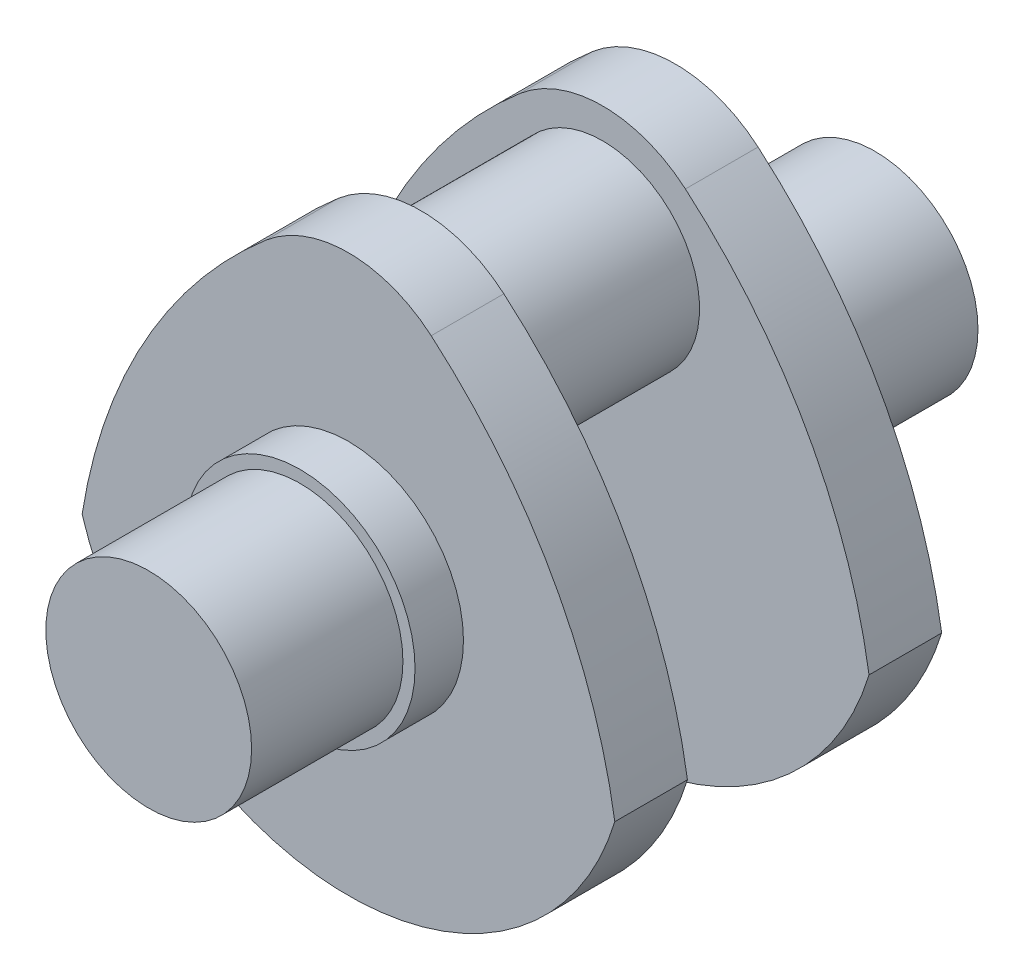
ISO-10303-21;
HEADER;
FILE_DESCRIPTION(('STEP AP214'),'2;1');
FILE_NAME('part.step','',(''),(''),'','','');
FILE_SCHEMA(('AUTOMOTIVE_DESIGN { 1 0 10303 214 1 1 1 1 }'));
ENDSEC;
DATA;
#1=APPLICATION_CONTEXT('core data for automotive mechanical design processes');
#2=APPLICATION_PROTOCOL_DEFINITION('international standard','automotive_design',2000,#1);
#3=PRODUCT_CONTEXT('',#1,'mechanical');
#4=PRODUCT('Part','Part','',(#3));
#5=PRODUCT_RELATED_PRODUCT_CATEGORY('part','',(#4));
#6=PRODUCT_DEFINITION_FORMATION('','',#4);
#7=PRODUCT_DEFINITION_CONTEXT('part definition',#1,'design');
#8=PRODUCT_DEFINITION('design','',#6,#7);
#9=PRODUCT_DEFINITION_SHAPE('','',#8);
#10=(LENGTH_UNIT() NAMED_UNIT(*) SI_UNIT(.MILLI.,.METRE.));
#11=(NAMED_UNIT(*) PLANE_ANGLE_UNIT() SI_UNIT($,.RADIAN.));
#12=(NAMED_UNIT(*) SI_UNIT($,.STERADIAN.) SOLID_ANGLE_UNIT());
#13=UNCERTAINTY_MEASURE_WITH_UNIT(LENGTH_MEASURE(1.E-05),#10,'distance_accuracy_value','');
#14=(GEOMETRIC_REPRESENTATION_CONTEXT(3) GLOBAL_UNCERTAINTY_ASSIGNED_CONTEXT((#13)) GLOBAL_UNIT_ASSIGNED_CONTEXT((#10,
#11,#12)) REPRESENTATION_CONTEXT('',''));
#15=CARTESIAN_POINT('',(0.,0.,0.));
#16=DIRECTION('',(0.,0.,1.));
#17=DIRECTION('',(1.,0.,0.));
#18=AXIS2_PLACEMENT_3D('',#15,#16,#17);
#19=CARTESIAN_POINT('',(0.,0.,250.));
#20=DIRECTION('',(0.,0.,-1.));
#21=DIRECTION('',(-1.,0.,0.));
#22=AXIS2_PLACEMENT_3D('',#19,#20,#21);
#23=CYLINDRICAL_SURFACE('',#22,170.);
#24=CARTESIAN_POINT('',(0.,0.,250.));
#25=DIRECTION('',(0.,0.,1.));
#26=DIRECTION('',(1.,0.,0.));
#27=AXIS2_PLACEMENT_3D('',#24,#25,#26);
#28=CIRCLE('',#27,170.);
#29=CARTESIAN_POINT('',(170.,0.,250.));
#30=VERTEX_POINT('',#29);
#31=EDGE_CURVE('E11',#30,#30,#28,.T.);
#32=ORIENTED_EDGE('',*,*,#31,.F.);
#33=EDGE_LOOP('',(#32));
#34=FACE_BOUND('',#33,.T.);
#35=CARTESIAN_POINT('',(0.,0.,0.));
#36=DIRECTION('',(0.,0.,1.));
#37=DIRECTION('',(1.,0.,0.));
#38=AXIS2_PLACEMENT_3D('',#35,#36,#37);
#39=CIRCLE('',#38,170.);
#40=CARTESIAN_POINT('',(170.,0.,0.));
#41=VERTEX_POINT('',#40);
#42=EDGE_CURVE('E42',#41,#41,#39,.T.);
#43=ORIENTED_EDGE('',*,*,#42,.T.);
#44=EDGE_LOOP('',(#43));
#45=FACE_BOUND('',#44,.T.);
#46=ADVANCED_FACE('F39',(#34,#45),#23,.T.);
#47=CARTESIAN_POINT('',(0.,0.,250.));
#48=DIRECTION('',(0.,0.,1.));
#49=DIRECTION('',(1.,0.,0.));
#50=AXIS2_PLACEMENT_3D('',#47,#48,#49);
#51=PLANE('',#50);
#52=ORIENTED_EDGE('',*,*,#31,.T.);
#53=EDGE_LOOP('',(#52));
#54=FACE_BOUND('',#53,.T.);
#55=ADVANCED_FACE('F248',(#54),#51,.T.);
#56=CARTESIAN_POINT('',(0.,0.,-80.));
#57=DIRECTION('',(0.,0.,1.));
#58=DIRECTION('',(1.,0.,0.));
#59=AXIS2_PLACEMENT_3D('',#56,#57,#58);
#60=CYLINDRICAL_SURFACE('',#59,190.);
#61=CARTESIAN_POINT('',(0.,0.,-80.));
#62=DIRECTION('',(0.,0.,-1.));
#63=DIRECTION('',(-1.,0.,0.));
#64=AXIS2_PLACEMENT_3D('',#61,#62,#63);
#65=CIRCLE('',#64,190.);
#66=CARTESIAN_POINT('',(-190.,0.,-80.));
#67=VERTEX_POINT('',#66);
#68=EDGE_CURVE('E226',#67,#67,#65,.T.);
#69=ORIENTED_EDGE('',*,*,#68,.F.);
#70=EDGE_LOOP('',(#69));
#71=FACE_BOUND('',#70,.T.);
#72=CARTESIAN_POINT('',(0.,0.,0.));
#73=DIRECTION('',(0.,0.,-1.));
#74=DIRECTION('',(-1.,0.,0.));
#75=AXIS2_PLACEMENT_3D('',#72,#73,#74);
#76=CIRCLE('',#75,190.);
#77=CARTESIAN_POINT('',(-190.,0.,0.));
#78=VERTEX_POINT('',#77);
#79=EDGE_CURVE('E225',#78,#78,#76,.T.);
#80=ORIENTED_EDGE('',*,*,#79,.T.);
#81=EDGE_LOOP('',(#80));
#82=FACE_BOUND('',#81,.T.);
#83=ADVANCED_FACE('F234',(#71,#82),#60,.T.);
#84=CARTESIAN_POINT('',(0.,0.,0.));
#85=DIRECTION('',(0.,0.,-1.));
#86=DIRECTION('',(-1.,0.,0.));
#87=AXIS2_PLACEMENT_3D('',#84,#85,#86);
#88=PLANE('',#87);
#89=ORIENTED_EDGE('',*,*,#42,.F.);
#90=EDGE_LOOP('',(#89));
#91=FACE_BOUND('',#90,.T.);
#92=ORIENTED_EDGE('',*,*,#79,.F.);
#93=EDGE_LOOP('',(#92));
#94=FACE_BOUND('',#93,.T.);
#95=ADVANCED_FACE('F236',(#91,#94),#88,.F.);
#96=CARTESIAN_POINT('',(-449.094542035734,-273.845485151599,-200.));
#97=DIRECTION('',(0.,0.,1.));
#98=DIRECTION('',(1.,0.,0.));
#99=AXIS2_PLACEMENT_3D('',#96,#97,#98);
#100=CYLINDRICAL_SURFACE('',#99,900.);
#101=CARTESIAN_POINT('',(-449.094542035734,-273.845485151599,-80.));
#102=DIRECTION('',(0.,0.,-1.));
#103=DIRECTION('',(-1.,0.,0.));
#104=AXIS2_PLACEMENT_3D('',#101,#102,#103);
#105=CIRCLE('',#104,900.);
#106=CARTESIAN_POINT('',(136.680947576093,409.431234611356,-80.));
#107=VERTEX_POINT('',#106);
#108=CARTESIAN_POINT('',(440.,-134.164078649987,-80.));
#109=VERTEX_POINT('',#108);
#110=EDGE_CURVE('E192',#107,#109,#105,.T.);
#111=ORIENTED_EDGE('',*,*,#110,.T.);
#112=DIRECTION('',(0.,0.,1.));
#113=VECTOR('',#112,1.);
#114=CARTESIAN_POINT('',(440.,-134.164078649987,-200.));
#115=LINE('',#114,#113);
#116=CARTESIAN_POINT('',(440.,-134.164078649987,-200.));
#117=VERTEX_POINT('',#116);
#118=EDGE_CURVE('E222',#117,#109,#115,.T.);
#119=ORIENTED_EDGE('',*,*,#118,.F.);
#120=CARTESIAN_POINT('',(-449.094542035734,-273.845485151599,-200.));
#121=DIRECTION('',(0.,0.,-1.));
#122=DIRECTION('',(-1.,0.,0.));
#123=AXIS2_PLACEMENT_3D('',#120,#121,#122);
#124=CIRCLE('',#123,900.);
#125=CARTESIAN_POINT('',(136.680947576093,409.431234611356,-200.));
#126=VERTEX_POINT('',#125);
#127=EDGE_CURVE('E193',#126,#117,#124,.T.);
#128=ORIENTED_EDGE('',*,*,#127,.F.);
#129=DIRECTION('',(0.,0.,1.));
#130=VECTOR('',#129,1.);
#131=CARTESIAN_POINT('',(136.680947576093,409.431234611356,-200.));
#132=LINE('',#131,#130);
#133=EDGE_CURVE('E203',#126,#107,#132,.T.);
#134=ORIENTED_EDGE('',*,*,#133,.T.);
#135=EDGE_LOOP('',(#111,#119,#128,#134));
#136=FACE_BOUND('',#135,.T.);
#137=ADVANCED_FACE('F238',(#136),#100,.T.);
#138=CARTESIAN_POINT('',(0.,0.,-200.));
#139=DIRECTION('',(0.,0.,1.));
#140=DIRECTION('',(1.,0.,0.));
#141=AXIS2_PLACEMENT_3D('',#138,#139,#140);
#142=CYLINDRICAL_SURFACE('',#141,460.);
#143=CARTESIAN_POINT('',(0.,0.,-80.));
#144=DIRECTION('',(0.,0.,-1.));
#145=DIRECTION('',(-1.,0.,0.));
#146=AXIS2_PLACEMENT_3D('',#143,#144,#145);
#147=CIRCLE('',#146,460.);
#148=CARTESIAN_POINT('',(-440.,-134.164078649987,-80.));
#149=VERTEX_POINT('',#148);
#150=EDGE_CURVE('E207',#109,#149,#147,.T.);
#151=ORIENTED_EDGE('',*,*,#150,.T.);
#152=DIRECTION('',(0.,0.,1.));
#153=VECTOR('',#152,1.);
#154=CARTESIAN_POINT('',(-440.,-134.164078649987,-200.));
#155=LINE('',#154,#153);
#156=CARTESIAN_POINT('',(-440.,-134.164078649987,-200.));
#157=VERTEX_POINT('',#156);
#158=EDGE_CURVE('E219',#157,#149,#155,.T.);
#159=ORIENTED_EDGE('',*,*,#158,.F.);
#160=CARTESIAN_POINT('',(0.,0.,-200.));
#161=DIRECTION('',(0.,0.,-1.));
#162=DIRECTION('',(-1.,0.,0.));
#163=AXIS2_PLACEMENT_3D('',#160,#161,#162);
#164=CIRCLE('',#163,460.);
#165=EDGE_CURVE('E88',#117,#157,#164,.T.);
#166=ORIENTED_EDGE('',*,*,#165,.F.);
#167=ORIENTED_EDGE('',*,*,#118,.T.);
#168=EDGE_LOOP('',(#151,#159,#166,#167));
#169=FACE_BOUND('',#168,.T.);
#170=ADVANCED_FACE('F245',(#169),#142,.T.);
#171=CARTESIAN_POINT('',(449.094542035734,-273.845485151599,-200.));
#172=DIRECTION('',(0.,0.,1.));
#173=DIRECTION('',(1.,0.,0.));
#174=AXIS2_PLACEMENT_3D('',#171,#172,#173);
#175=CYLINDRICAL_SURFACE('',#174,900.);
#176=CARTESIAN_POINT('',(449.094542035734,-273.845485151599,-80.));
#177=DIRECTION('',(0.,0.,-1.));
#178=DIRECTION('',(1.,0.,0.));
#179=AXIS2_PLACEMENT_3D('',#176,#177,#178);
#180=CIRCLE('',#179,900.);
#181=CARTESIAN_POINT('',(-136.680947576093,409.431234611356,-80.));
#182=VERTEX_POINT('',#181);
#183=EDGE_CURVE('E74',#149,#182,#180,.T.);
#184=ORIENTED_EDGE('',*,*,#183,.T.);
#185=DIRECTION('',(0.,0.,1.));
#186=VECTOR('',#185,1.);
#187=CARTESIAN_POINT('',(-136.680947576093,409.431234611356,-200.));
#188=LINE('',#187,#186);
#189=CARTESIAN_POINT('',(-136.680947576093,409.431234611356,-200.));
#190=VERTEX_POINT('',#189);
#191=EDGE_CURVE('E216',#190,#182,#188,.T.);
#192=ORIENTED_EDGE('',*,*,#191,.F.);
#193=CARTESIAN_POINT('',(449.094542035734,-273.845485151599,-200.));
#194=DIRECTION('',(0.,0.,-1.));
#195=DIRECTION('',(1.,0.,0.));
#196=AXIS2_PLACEMENT_3D('',#193,#194,#195);
#197=CIRCLE('',#196,900.);
#198=EDGE_CURVE('E198',#157,#190,#197,.T.);
#199=ORIENTED_EDGE('',*,*,#198,.F.);
#200=ORIENTED_EDGE('',*,*,#158,.T.);
#201=EDGE_LOOP('',(#184,#192,#199,#200));
#202=FACE_BOUND('',#201,.T.);
#203=ADVANCED_FACE('F287',(#202),#175,.T.);
#204=CARTESIAN_POINT('',(0.,250.,-200.));
#205=DIRECTION('',(0.,0.,1.));
#206=DIRECTION('',(1.,0.,0.));
#207=AXIS2_PLACEMENT_3D('',#204,#205,#206);
#208=CYLINDRICAL_SURFACE('',#207,210.);
#209=CARTESIAN_POINT('',(0.,250.,-80.));
#210=DIRECTION('',(0.,0.,-1.));
#211=DIRECTION('',(-1.,0.,0.));
#212=AXIS2_PLACEMENT_3D('',#209,#210,#211);
#213=CIRCLE('',#212,210.);
#214=EDGE_CURVE('E80',#182,#107,#213,.T.);
#215=ORIENTED_EDGE('',*,*,#214,.T.);
#216=ORIENTED_EDGE('',*,*,#133,.F.);
#217=CARTESIAN_POINT('',(0.,250.,-200.));
#218=DIRECTION('',(0.,0.,-1.));
#219=DIRECTION('',(-1.,0.,0.));
#220=AXIS2_PLACEMENT_3D('',#217,#218,#219);
#221=CIRCLE('',#220,210.);
#222=EDGE_CURVE('E56',#190,#126,#221,.T.);
#223=ORIENTED_EDGE('',*,*,#222,.F.);
#224=ORIENTED_EDGE('',*,*,#191,.T.);
#225=EDGE_LOOP('',(#215,#216,#223,#224));
#226=FACE_BOUND('',#225,.T.);
#227=ADVANCED_FACE('F295',(#226),#208,.T.);
#228=CARTESIAN_POINT('',(-224.547271017867,-136.9227425758,-200.));
#229=DIRECTION('',(0.,0.,-1.));
#230=DIRECTION('',(-1.,0.,0.));
#231=AXIS2_PLACEMENT_3D('',#228,#229,#230);
#232=PLANE('',#231);
#233=CARTESIAN_POINT('',(0.,250.,-200.));
#234=DIRECTION('',(0.,0.,-1.));
#235=DIRECTION('',(-1.,0.,0.));
#236=AXIS2_PLACEMENT_3D('',#233,#234,#235);
#237=CIRCLE('',#236,160.);
#238=CARTESIAN_POINT('',(-160.,250.,-200.));
#239=VERTEX_POINT('',#238);
#240=EDGE_CURVE('E185',#239,#239,#237,.T.);
#241=ORIENTED_EDGE('',*,*,#240,.F.);
#242=EDGE_LOOP('',(#241));
#243=FACE_BOUND('',#242,.T.);
#244=ORIENTED_EDGE('',*,*,#127,.T.);
#245=ORIENTED_EDGE('',*,*,#165,.T.);
#246=ORIENTED_EDGE('',*,*,#198,.T.);
#247=ORIENTED_EDGE('',*,*,#222,.T.);
#248=EDGE_LOOP('',(#244,#245,#246,#247));
#249=FACE_BOUND('',#248,.T.);
#250=ADVANCED_FACE('F303',(#243,#249),#232,.T.);
#251=CARTESIAN_POINT('',(-224.547271017867,-136.9227425758,-80.));
#252=DIRECTION('',(0.,0.,-1.));
#253=DIRECTION('',(-1.,0.,0.));
#254=AXIS2_PLACEMENT_3D('',#251,#252,#253);
#255=PLANE('',#254);
#256=ORIENTED_EDGE('',*,*,#68,.T.);
#257=EDGE_LOOP('',(#256));
#258=FACE_BOUND('',#257,.T.);
#259=ORIENTED_EDGE('',*,*,#110,.F.);
#260=ORIENTED_EDGE('',*,*,#214,.F.);
#261=ORIENTED_EDGE('',*,*,#183,.F.);
#262=ORIENTED_EDGE('',*,*,#150,.F.);
#263=EDGE_LOOP('',(#259,#260,#261,#262));
#264=FACE_BOUND('',#263,.T.);
#265=ADVANCED_FACE('F308',(#258,#264),#255,.F.);
#266=CARTESIAN_POINT('',(0.,250.,-350.));
#267=DIRECTION('',(0.,0.,1.));
#268=DIRECTION('',(1.,0.,0.));
#269=AXIS2_PLACEMENT_3D('',#266,#267,#268);
#270=CYLINDRICAL_SURFACE('',#269,160.);
#271=ORIENTED_EDGE('',*,*,#240,.T.);
#272=EDGE_LOOP('',(#271));
#273=FACE_BOUND('',#272,.T.);
#274=CARTESIAN_POINT('',(0.,250.,-500.));
#275=DIRECTION('',(0.,0.,-1.));
#276=DIRECTION('',(-1.,0.,0.));
#277=AXIS2_PLACEMENT_3D('',#274,#275,#276);
#278=CIRCLE('',#277,160.);
#279=CARTESIAN_POINT('',(-160.,250.,-500.));
#280=VERTEX_POINT('',#279);
#281=EDGE_CURVE('E150',#280,#280,#278,.T.);
#282=ORIENTED_EDGE('',*,*,#281,.F.);
#283=EDGE_LOOP('',(#282));
#284=FACE_BOUND('',#283,.T.);
#285=ADVANCED_FACE('F312',(#273,#284),#270,.T.);
#286=CARTESIAN_POINT('',(0.,0.,-950.));
#287=DIRECTION('',(0.,0.,1.));
#288=DIRECTION('',(-1.,0.,0.));
#289=AXIS2_PLACEMENT_3D('',#286,#287,#288);
#290=CYLINDRICAL_SURFACE('',#289,170.);
#291=CARTESIAN_POINT('',(0.,0.,-950.));
#292=DIRECTION('',(0.,0.,1.));
#293=DIRECTION('',(1.,0.,0.));
#294=AXIS2_PLACEMENT_3D('',#291,#292,#293);
#295=CIRCLE('',#294,170.);
#296=CARTESIAN_POINT('',(170.,0.,-950.));
#297=VERTEX_POINT('',#296);
#298=EDGE_CURVE('E181',#297,#297,#295,.T.);
#299=ORIENTED_EDGE('',*,*,#298,.T.);
#300=EDGE_LOOP('',(#299));
#301=FACE_BOUND('',#300,.T.);
#302=CARTESIAN_POINT('',(0.,0.,-700.));
#303=DIRECTION('',(0.,0.,1.));
#304=DIRECTION('',(1.,0.,0.));
#305=AXIS2_PLACEMENT_3D('',#302,#303,#304);
#306=CIRCLE('',#305,170.);
#307=CARTESIAN_POINT('',(170.,0.,-700.));
#308=VERTEX_POINT('',#307);
#309=EDGE_CURVE('E177',#308,#308,#306,.T.);
#310=ORIENTED_EDGE('',*,*,#309,.F.);
#311=EDGE_LOOP('',(#310));
#312=FACE_BOUND('',#311,.T.);
#313=ADVANCED_FACE('F330',(#301,#312),#290,.T.);
#314=CARTESIAN_POINT('',(0.,0.,-950.));
#315=DIRECTION('',(0.,0.,-1.));
#316=DIRECTION('',(1.,0.,0.));
#317=AXIS2_PLACEMENT_3D('',#314,#315,#316);
#318=PLANE('',#317);
#319=ORIENTED_EDGE('',*,*,#298,.F.);
#320=EDGE_LOOP('',(#319));
#321=FACE_BOUND('',#320,.T.);
#322=ADVANCED_FACE('F340',(#321),#318,.T.);
#323=CARTESIAN_POINT('',(0.,0.,-620.));
#324=DIRECTION('',(0.,0.,-1.));
#325=DIRECTION('',(1.,0.,0.));
#326=AXIS2_PLACEMENT_3D('',#323,#324,#325);
#327=CYLINDRICAL_SURFACE('',#326,190.);
#328=CARTESIAN_POINT('',(0.,0.,-620.));
#329=DIRECTION('',(0.,0.,-1.));
#330=DIRECTION('',(-1.,0.,0.));
#331=AXIS2_PLACEMENT_3D('',#328,#329,#330);
#332=CIRCLE('',#331,190.);
#333=CARTESIAN_POINT('',(-190.,0.,-620.));
#334=VERTEX_POINT('',#333);
#335=EDGE_CURVE('E173',#334,#334,#332,.T.);
#336=ORIENTED_EDGE('',*,*,#335,.T.);
#337=EDGE_LOOP('',(#336));
#338=FACE_BOUND('',#337,.T.);
#339=CARTESIAN_POINT('',(0.,0.,-700.));
#340=DIRECTION('',(0.,0.,-1.));
#341=DIRECTION('',(-1.,0.,0.));
#342=AXIS2_PLACEMENT_3D('',#339,#340,#341);
#343=CIRCLE('',#342,190.);
#344=CARTESIAN_POINT('',(-190.,0.,-700.));
#345=VERTEX_POINT('',#344);
#346=EDGE_CURVE('E137',#345,#345,#343,.T.);
#347=ORIENTED_EDGE('',*,*,#346,.F.);
#348=EDGE_LOOP('',(#347));
#349=FACE_BOUND('',#348,.T.);
#350=ADVANCED_FACE('F350',(#338,#349),#327,.T.);
#351=CARTESIAN_POINT('',(0.,0.,-700.));
#352=DIRECTION('',(0.,0.,1.));
#353=DIRECTION('',(-1.,0.,0.));
#354=AXIS2_PLACEMENT_3D('',#351,#352,#353);
#355=PLANE('',#354);
#356=ORIENTED_EDGE('',*,*,#309,.T.);
#357=EDGE_LOOP('',(#356));
#358=FACE_BOUND('',#357,.T.);
#359=ORIENTED_EDGE('',*,*,#346,.T.);
#360=EDGE_LOOP('',(#359));
#361=FACE_BOUND('',#360,.T.);
#362=ADVANCED_FACE('F360',(#358,#361),#355,.F.);
#363=CARTESIAN_POINT('',(-449.094542035734,-273.845485151599,-500.));
#364=DIRECTION('',(0.,0.,-1.));
#365=DIRECTION('',(1.,0.,0.));
#366=AXIS2_PLACEMENT_3D('',#363,#364,#365);
#367=CYLINDRICAL_SURFACE('',#366,900.);
#368=CARTESIAN_POINT('',(-449.094542035734,-273.845485151599,-620.));
#369=DIRECTION('',(0.,0.,-1.));
#370=DIRECTION('',(-1.,0.,0.));
#371=AXIS2_PLACEMENT_3D('',#368,#369,#370);
#372=CIRCLE('',#371,900.);
#373=CARTESIAN_POINT('',(136.680947576093,409.431234611356,-620.));
#374=VERTEX_POINT('',#373);
#375=CARTESIAN_POINT('',(440.,-134.164078649987,-620.));
#376=VERTEX_POINT('',#375);
#377=EDGE_CURVE('E157',#374,#376,#372,.T.);
#378=ORIENTED_EDGE('',*,*,#377,.F.);
#379=DIRECTION('',(0.,0.,-1.));
#380=VECTOR('',#379,1.);
#381=CARTESIAN_POINT('',(136.680947576093,409.431234611356,-500.));
#382=LINE('',#381,#380);
#383=CARTESIAN_POINT('',(136.680947576093,409.431234611356,-500.));
#384=VERTEX_POINT('',#383);
#385=EDGE_CURVE('E142',#384,#374,#382,.T.);
#386=ORIENTED_EDGE('',*,*,#385,.F.);
#387=CARTESIAN_POINT('',(-449.094542035734,-273.845485151599,-500.));
#388=DIRECTION('',(0.,0.,-1.));
#389=DIRECTION('',(-1.,0.,0.));
#390=AXIS2_PLACEMENT_3D('',#387,#388,#389);
#391=CIRCLE('',#390,900.);
#392=CARTESIAN_POINT('',(440.,-134.164078649987,-500.));
#393=VERTEX_POINT('',#392);
#394=EDGE_CURVE('E119',#384,#393,#391,.T.);
#395=ORIENTED_EDGE('',*,*,#394,.T.);
#396=DIRECTION('',(0.,0.,-1.));
#397=VECTOR('',#396,1.);
#398=CARTESIAN_POINT('',(440.,-134.164078649987,-500.));
#399=LINE('',#398,#397);
#400=EDGE_CURVE('E129',#393,#376,#399,.T.);
#401=ORIENTED_EDGE('',*,*,#400,.T.);
#402=EDGE_LOOP('',(#378,#386,#395,#401));
#403=FACE_BOUND('',#402,.T.);
#404=ADVANCED_FACE('F140',(#403),#367,.T.);
#405=CARTESIAN_POINT('',(0.,0.,-500.));
#406=DIRECTION('',(0.,0.,-1.));
#407=DIRECTION('',(1.,0.,0.));
#408=AXIS2_PLACEMENT_3D('',#405,#406,#407);
#409=CYLINDRICAL_SURFACE('',#408,460.);
#410=CARTESIAN_POINT('',(0.,0.,-620.));
#411=DIRECTION('',(0.,0.,-1.));
#412=DIRECTION('',(-1.,0.,0.));
#413=AXIS2_PLACEMENT_3D('',#410,#411,#412);
#414=CIRCLE('',#413,460.);
#415=CARTESIAN_POINT('',(-440.,-134.164078649987,-620.));
#416=VERTEX_POINT('',#415);
#417=EDGE_CURVE('E132',#376,#416,#414,.T.);
#418=ORIENTED_EDGE('',*,*,#417,.F.);
#419=ORIENTED_EDGE('',*,*,#400,.F.);
#420=CARTESIAN_POINT('',(0.,0.,-500.));
#421=DIRECTION('',(0.,0.,-1.));
#422=DIRECTION('',(-1.,0.,0.));
#423=AXIS2_PLACEMENT_3D('',#420,#421,#422);
#424=CIRCLE('',#423,460.);
#425=CARTESIAN_POINT('',(-440.,-134.164078649987,-500.));
#426=VERTEX_POINT('',#425);
#427=EDGE_CURVE('E115',#393,#426,#424,.T.);
#428=ORIENTED_EDGE('',*,*,#427,.T.);
#429=DIRECTION('',(0.,0.,-1.));
#430=VECTOR('',#429,1.);
#431=CARTESIAN_POINT('',(-440.,-134.164078649987,-500.));
#432=LINE('',#431,#430);
#433=EDGE_CURVE('E138',#426,#416,#432,.T.);
#434=ORIENTED_EDGE('',*,*,#433,.T.);
#435=EDGE_LOOP('',(#418,#419,#428,#434));
#436=FACE_BOUND('',#435,.T.);
#437=ADVANCED_FACE('F130',(#436),#409,.T.);
#438=CARTESIAN_POINT('',(449.094542035734,-273.845485151599,-500.));
#439=DIRECTION('',(0.,0.,-1.));
#440=DIRECTION('',(1.,0.,0.));
#441=AXIS2_PLACEMENT_3D('',#438,#439,#440);
#442=CYLINDRICAL_SURFACE('',#441,900.);
#443=CARTESIAN_POINT('',(449.094542035734,-273.845485151599,-620.));
#444=DIRECTION('',(0.,0.,-1.));
#445=DIRECTION('',(1.,0.,0.));
#446=AXIS2_PLACEMENT_3D('',#443,#444,#445);
#447=CIRCLE('',#446,900.);
#448=CARTESIAN_POINT('',(-136.680947576093,409.431234611356,-620.));
#449=VERTEX_POINT('',#448);
#450=EDGE_CURVE('E147',#416,#449,#447,.T.);
#451=ORIENTED_EDGE('',*,*,#450,.F.);
#452=ORIENTED_EDGE('',*,*,#433,.F.);
#453=CARTESIAN_POINT('',(449.094542035734,-273.845485151599,-500.));
#454=DIRECTION('',(0.,0.,-1.));
#455=DIRECTION('',(1.,0.,0.));
#456=AXIS2_PLACEMENT_3D('',#453,#454,#455);
#457=CIRCLE('',#456,900.);
#458=CARTESIAN_POINT('',(-136.680947576093,409.431234611356,-500.));
#459=VERTEX_POINT('',#458);
#460=EDGE_CURVE('E122',#426,#459,#457,.T.);
#461=ORIENTED_EDGE('',*,*,#460,.T.);
#462=DIRECTION('',(0.,0.,-1.));
#463=VECTOR('',#462,1.);
#464=CARTESIAN_POINT('',(-136.680947576093,409.431234611356,-500.));
#465=LINE('',#464,#463);
#466=EDGE_CURVE('E167',#459,#449,#465,.T.);
#467=ORIENTED_EDGE('',*,*,#466,.T.);
#468=EDGE_LOOP('',(#451,#452,#461,#467));
#469=FACE_BOUND('',#468,.T.);
#470=ADVANCED_FACE('F387',(#469),#442,.T.);
#471=CARTESIAN_POINT('',(0.,250.,-500.));
#472=DIRECTION('',(0.,0.,-1.));
#473=DIRECTION('',(1.,0.,0.));
#474=AXIS2_PLACEMENT_3D('',#471,#472,#473);
#475=CYLINDRICAL_SURFACE('',#474,210.);
#476=CARTESIAN_POINT('',(0.,250.,-620.));
#477=DIRECTION('',(0.,0.,-1.));
#478=DIRECTION('',(-1.,0.,0.));
#479=AXIS2_PLACEMENT_3D('',#476,#477,#478);
#480=CIRCLE('',#479,210.);
#481=EDGE_CURVE('E144',#449,#374,#480,.T.);
#482=ORIENTED_EDGE('',*,*,#481,.F.);
#483=ORIENTED_EDGE('',*,*,#466,.F.);
#484=CARTESIAN_POINT('',(0.,250.,-500.));
#485=DIRECTION('',(0.,0.,-1.));
#486=DIRECTION('',(-1.,0.,0.));
#487=AXIS2_PLACEMENT_3D('',#484,#485,#486);
#488=CIRCLE('',#487,210.);
#489=EDGE_CURVE('E154',#459,#384,#488,.T.);
#490=ORIENTED_EDGE('',*,*,#489,.T.);
#491=ORIENTED_EDGE('',*,*,#385,.T.);
#492=EDGE_LOOP('',(#482,#483,#490,#491));
#493=FACE_BOUND('',#492,.T.);
#494=ADVANCED_FACE('F396',(#493),#475,.T.);
#495=CARTESIAN_POINT('',(-224.547271017867,-136.9227425758,-500.));
#496=DIRECTION('',(0.,0.,1.));
#497=DIRECTION('',(-1.,0.,0.));
#498=AXIS2_PLACEMENT_3D('',#495,#496,#497);
#499=PLANE('',#498);
#500=ORIENTED_EDGE('',*,*,#281,.T.);
#501=EDGE_LOOP('',(#500));
#502=FACE_BOUND('',#501,.T.);
#503=ORIENTED_EDGE('',*,*,#394,.F.);
#504=ORIENTED_EDGE('',*,*,#489,.F.);
#505=ORIENTED_EDGE('',*,*,#460,.F.);
#506=ORIENTED_EDGE('',*,*,#427,.F.);
#507=EDGE_LOOP('',(#503,#504,#505,#506));
#508=FACE_BOUND('',#507,.T.);
#509=ADVANCED_FACE('F117',(#502,#508),#499,.T.);
#510=CARTESIAN_POINT('',(-224.547271017867,-136.9227425758,-620.));
#511=DIRECTION('',(0.,0.,1.));
#512=DIRECTION('',(-1.,0.,0.));
#513=AXIS2_PLACEMENT_3D('',#510,#511,#512);
#514=PLANE('',#513);
#515=ORIENTED_EDGE('',*,*,#335,.F.);
#516=EDGE_LOOP('',(#515));
#517=FACE_BOUND('',#516,.T.);
#518=ORIENTED_EDGE('',*,*,#377,.T.);
#519=ORIENTED_EDGE('',*,*,#417,.T.);
#520=ORIENTED_EDGE('',*,*,#450,.T.);
#521=ORIENTED_EDGE('',*,*,#481,.T.);
#522=EDGE_LOOP('',(#518,#519,#520,#521));
#523=FACE_BOUND('',#522,.T.);
#524=ADVANCED_FACE('F415',(#517,#523),#514,.F.);
#525=CLOSED_SHELL('',(#46,#55,#83,#95,#137,#170,#203,#227,#250,#265,#285,#313,#322,#350,#362,
#404,#437,#470,#494,#509,#524));
#526=MANIFOLD_SOLID_BREP('B2',#525);
#527=ADVANCED_BREP_SHAPE_REPRESENTATION('',(#18,#526),#14);
#528=SHAPE_DEFINITION_REPRESENTATION(#9,#527);
ENDSEC;
END-ISO-10303-21;
